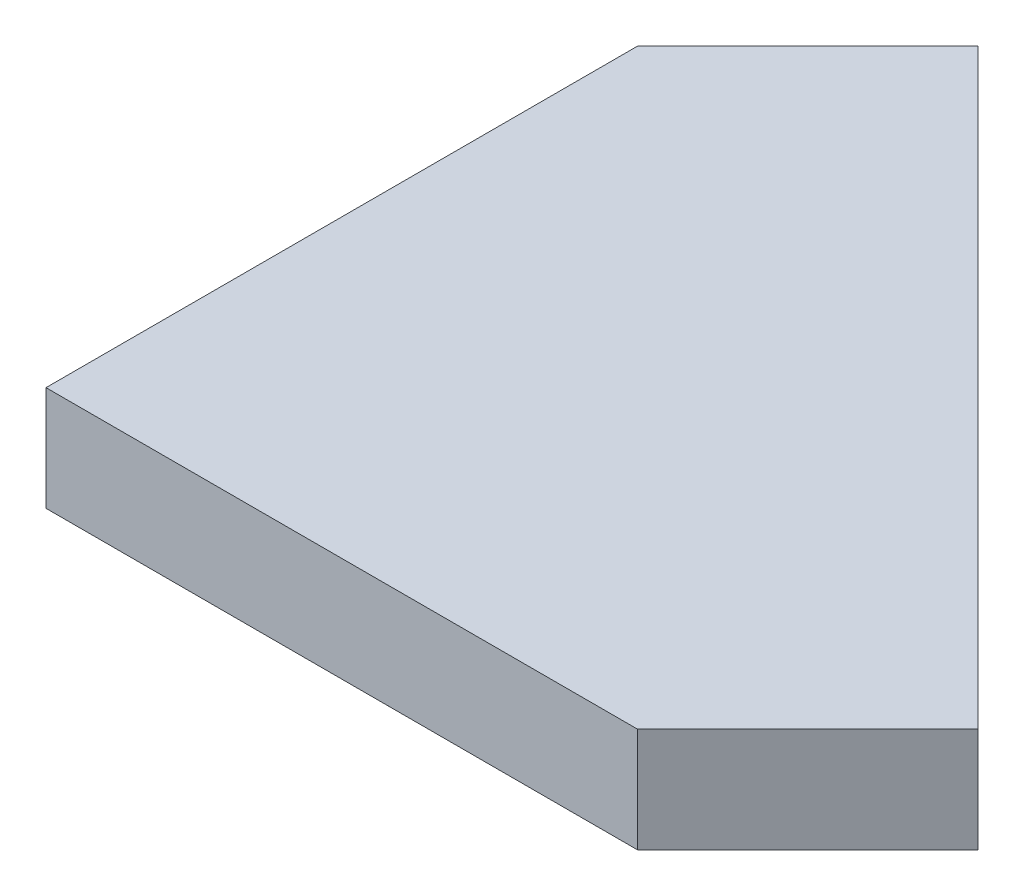
ISO-10303-21;
HEADER;
FILE_DESCRIPTION(('STEP AP214'),'2;1');
FILE_NAME('part.step','',(''),(''),'','','');
FILE_SCHEMA(('AUTOMOTIVE_DESIGN { 1 0 10303 214 1 1 1 1 }'));
ENDSEC;
DATA;
#1=APPLICATION_CONTEXT('core data for automotive mechanical design processes');
#2=APPLICATION_PROTOCOL_DEFINITION('international standard','automotive_design',2000,#1);
#3=PRODUCT_CONTEXT('',#1,'mechanical');
#4=PRODUCT('Part','Part','',(#3));
#5=PRODUCT_RELATED_PRODUCT_CATEGORY('part','',(#4));
#6=PRODUCT_DEFINITION_FORMATION('','',#4);
#7=PRODUCT_DEFINITION_CONTEXT('part definition',#1,'design');
#8=PRODUCT_DEFINITION('design','',#6,#7);
#9=PRODUCT_DEFINITION_SHAPE('','',#8);
#10=(LENGTH_UNIT() NAMED_UNIT(*) SI_UNIT(.MILLI.,.METRE.));
#11=(NAMED_UNIT(*) PLANE_ANGLE_UNIT() SI_UNIT($,.RADIAN.));
#12=(NAMED_UNIT(*) SI_UNIT($,.STERADIAN.) SOLID_ANGLE_UNIT());
#13=UNCERTAINTY_MEASURE_WITH_UNIT(LENGTH_MEASURE(1.E-05),#10,'distance_accuracy_value','');
#14=(GEOMETRIC_REPRESENTATION_CONTEXT(3) GLOBAL_UNCERTAINTY_ASSIGNED_CONTEXT((#13)) GLOBAL_UNIT_ASSIGNED_CONTEXT((#10,
#11,#12)) REPRESENTATION_CONTEXT('',''));
#15=CARTESIAN_POINT('',(0.,0.,0.));
#16=DIRECTION('',(0.,0.,1.));
#17=DIRECTION('',(1.,0.,0.));
#18=AXIS2_PLACEMENT_3D('',#15,#16,#17);
#19=CARTESIAN_POINT('',(0.,0.2,0.));
#20=DIRECTION('',(0.,1.,0.));
#21=DIRECTION('',(-1.,0.,0.));
#22=AXIS2_PLACEMENT_3D('',#19,#20,#21);
#23=PLANE('',#22);
#24=DIRECTION('',(0.707106781186551,0.,0.707106781186544));
#25=VECTOR('',#24,1.);
#26=CARTESIAN_POINT('',(-2.79289321881343,0.199999999999986,3.92426406871196));
#27=LINE('',#26,#25);
#28=CARTESIAN_POINT('',(-3.92426406871191,0.19999999999999,2.79289321881348));
#29=VERTEX_POINT('',#28);
#30=CARTESIAN_POINT('',(-2.79289321881343,0.199999999999986,3.92426406871196));
#31=VERTEX_POINT('',#30);
#32=EDGE_CURVE('E11',#29,#31,#27,.T.);
#33=ORIENTED_EDGE('',*,*,#32,.F.);
#34=DIRECTION('',(0.70710678118665,0.,-0.707106781186445));
#35=VECTOR('',#34,1.);
#36=CARTESIAN_POINT('',(-3.92426406871191,0.19999999999999,2.79289321881348));
#37=LINE('',#36,#35);
#38=CARTESIAN_POINT('',(-4.24999999999998,0.199999999999989,3.11862915010145));
#39=VERTEX_POINT('',#38);
#40=EDGE_CURVE('E24',#39,#29,#37,.T.);
#41=ORIENTED_EDGE('',*,*,#40,.F.);
#42=DIRECTION('',(0.,0.,-1.));
#43=VECTOR('',#42,1.);
#44=CARTESIAN_POINT('',(-4.24999999999998,0.199999999999989,3.11862915010146));
#45=LINE('',#44,#43);
#46=CARTESIAN_POINT('',(-4.24999999999998,0.199999999999985,4.25000000000002));
#47=VERTEX_POINT('',#46);
#48=EDGE_CURVE('E81',#47,#39,#45,.T.);
#49=ORIENTED_EDGE('',*,*,#48,.F.);
#50=DIRECTION('',(-1.,0.,0.));
#51=VECTOR('',#50,1.);
#52=CARTESIAN_POINT('',(-4.24999999999998,0.199999999999985,4.25000000000002));
#53=LINE('',#52,#51);
#54=CARTESIAN_POINT('',(-3.11862915010149,0.199999999999986,4.25000000000002));
#55=VERTEX_POINT('',#54);
#56=EDGE_CURVE('E99',#55,#47,#53,.T.);
#57=ORIENTED_EDGE('',*,*,#56,.F.);
#58=DIRECTION('',(-0.707106781186547,0.,0.707106781186548));
#59=VECTOR('',#58,1.);
#60=CARTESIAN_POINT('',(-3.11862915010149,0.199999999999985,4.25000000000002));
#61=LINE('',#60,#59);
#62=EDGE_CURVE('E96',#31,#55,#61,.T.);
#63=ORIENTED_EDGE('',*,*,#62,.F.);
#64=EDGE_LOOP('',(#33,#41,#49,#57,#63));
#65=FACE_BOUND('',#64,.T.);
#66=ADVANCED_FACE('F17',(#65),#23,.T.);
#67=CARTESIAN_POINT('',(0.,0.,0.));
#68=DIRECTION('',(0.,1.,0.));
#69=DIRECTION('',(0.,0.,1.));
#70=AXIS2_PLACEMENT_3D('',#67,#68,#69);
#71=PLANE('',#70);
#72=DIRECTION('',(0.707106781186551,0.,0.707106781186544));
#73=VECTOR('',#72,1.);
#74=CARTESIAN_POINT('',(-2.79289321881343,0.,3.92426406871196));
#75=LINE('',#74,#73);
#76=CARTESIAN_POINT('',(-3.92426406871191,0.,2.79289321881348));
#77=VERTEX_POINT('',#76);
#78=CARTESIAN_POINT('',(-2.79289321881343,0.,3.92426406871196));
#79=VERTEX_POINT('',#78);
#80=EDGE_CURVE('E94',#77,#79,#75,.T.);
#81=ORIENTED_EDGE('',*,*,#80,.T.);
#82=DIRECTION('',(-0.707106781186547,0.,0.707106781186548));
#83=VECTOR('',#82,1.);
#84=CARTESIAN_POINT('',(-3.11862915010149,0.,4.25000000000002));
#85=LINE('',#84,#83);
#86=CARTESIAN_POINT('',(-3.11862915010149,0.,4.25000000000002));
#87=VERTEX_POINT('',#86);
#88=EDGE_CURVE('E92',#79,#87,#85,.T.);
#89=ORIENTED_EDGE('',*,*,#88,.T.);
#90=DIRECTION('',(-1.,0.,0.));
#91=VECTOR('',#90,1.);
#92=CARTESIAN_POINT('',(-4.24999999999998,0.,4.25000000000002));
#93=LINE('',#92,#91);
#94=CARTESIAN_POINT('',(-4.24999999999998,0.,4.25000000000002));
#95=VERTEX_POINT('',#94);
#96=EDGE_CURVE('E66',#87,#95,#93,.T.);
#97=ORIENTED_EDGE('',*,*,#96,.T.);
#98=DIRECTION('',(0.,0.,-1.));
#99=VECTOR('',#98,1.);
#100=CARTESIAN_POINT('',(-4.24999999999998,0.,3.11862915010145));
#101=LINE('',#100,#99);
#102=CARTESIAN_POINT('',(-4.24999999999998,0.,3.11862915010145));
#103=VERTEX_POINT('',#102);
#104=EDGE_CURVE('E60',#95,#103,#101,.T.);
#105=ORIENTED_EDGE('',*,*,#104,.T.);
#106=DIRECTION('',(0.70710678118665,0.,-0.707106781186445));
#107=VECTOR('',#106,1.);
#108=CARTESIAN_POINT('',(-3.92426406871191,0.,2.79289321881348));
#109=LINE('',#108,#107);
#110=EDGE_CURVE('E63',#103,#77,#109,.T.);
#111=ORIENTED_EDGE('',*,*,#110,.T.);
#112=EDGE_LOOP('',(#81,#89,#97,#105,#111));
#113=FACE_BOUND('',#112,.T.);
#114=ADVANCED_FACE('F62',(#113),#71,.F.);
#115=CARTESIAN_POINT('',(-3.11862915010149,4.22492235949961,4.25000000000003));
#116=DIRECTION('',(0.707106781186548,0.,0.707106781186547));
#117=DIRECTION('',(0.707106781186547,0.,-0.707106781186548));
#118=AXIS2_PLACEMENT_3D('',#115,#116,#117);
#119=PLANE('',#118);
#120=DIRECTION('',(0.,-1.,0.));
#121=VECTOR('',#120,1.);
#122=CARTESIAN_POINT('',(-2.79289321881343,4.22492235949961,3.92426406871197));
#123=LINE('',#122,#121);
#124=EDGE_CURVE('E77',#31,#79,#123,.T.);
#125=ORIENTED_EDGE('',*,*,#124,.F.);
#126=ORIENTED_EDGE('',*,*,#62,.T.);
#127=DIRECTION('',(0.,-1.,0.));
#128=VECTOR('',#127,1.);
#129=CARTESIAN_POINT('',(-3.11862915010149,4.22492235949961,4.25000000000003));
#130=LINE('',#129,#128);
#131=EDGE_CURVE('E84',#55,#87,#130,.T.);
#132=ORIENTED_EDGE('',*,*,#131,.T.);
#133=ORIENTED_EDGE('',*,*,#88,.F.);
#134=EDGE_LOOP('',(#125,#126,#132,#133));
#135=FACE_BOUND('',#134,.T.);
#136=ADVANCED_FACE('F106',(#135),#119,.T.);
#137=CARTESIAN_POINT('',(-4.24999999999998,4.22492235949961,4.25000000000003));
#138=DIRECTION('',(0.,0.,1.));
#139=DIRECTION('',(0.,-1.,0.));
#140=AXIS2_PLACEMENT_3D('',#137,#138,#139);
#141=PLANE('',#140);
#142=ORIENTED_EDGE('',*,*,#131,.F.);
#143=ORIENTED_EDGE('',*,*,#56,.T.);
#144=DIRECTION('',(0.,-1.,0.));
#145=VECTOR('',#144,1.);
#146=CARTESIAN_POINT('',(-4.24999999999998,4.22492235949961,4.25000000000003));
#147=LINE('',#146,#145);
#148=EDGE_CURVE('E82',#47,#95,#147,.T.);
#149=ORIENTED_EDGE('',*,*,#148,.T.);
#150=ORIENTED_EDGE('',*,*,#96,.F.);
#151=EDGE_LOOP('',(#142,#143,#149,#150));
#152=FACE_BOUND('',#151,.T.);
#153=ADVANCED_FACE('F109',(#152),#141,.T.);
#154=CARTESIAN_POINT('',(-4.24999999999998,4.22492235949961,3.11862915010147));
#155=DIRECTION('',(-1.,0.,0.));
#156=DIRECTION('',(0.,-1.,0.));
#157=AXIS2_PLACEMENT_3D('',#154,#155,#156);
#158=PLANE('',#157);
#159=ORIENTED_EDGE('',*,*,#148,.F.);
#160=ORIENTED_EDGE('',*,*,#48,.T.);
#161=DIRECTION('',(0.,-1.,0.));
#162=VECTOR('',#161,1.);
#163=CARTESIAN_POINT('',(-4.24999999999998,4.22492235949961,3.11862915010147));
#164=LINE('',#163,#162);
#165=EDGE_CURVE('E75',#39,#103,#164,.T.);
#166=ORIENTED_EDGE('',*,*,#165,.T.);
#167=ORIENTED_EDGE('',*,*,#104,.F.);
#168=EDGE_LOOP('',(#159,#160,#166,#167));
#169=FACE_BOUND('',#168,.T.);
#170=ADVANCED_FACE('F80',(#169),#158,.T.);
#171=CARTESIAN_POINT('',(-3.92426406871191,4.22492235949961,2.7928932188135));
#172=DIRECTION('',(-0.707106781186445,0.,-0.70710678118665));
#173=DIRECTION('',(-0.70710678118665,0.,0.707106781186445));
#174=AXIS2_PLACEMENT_3D('',#171,#172,#173);
#175=PLANE('',#174);
#176=ORIENTED_EDGE('',*,*,#165,.F.);
#177=ORIENTED_EDGE('',*,*,#40,.T.);
#178=DIRECTION('',(0.,-1.,0.));
#179=VECTOR('',#178,1.);
#180=CARTESIAN_POINT('',(-3.92426406871191,4.22492235949961,2.7928932188135));
#181=LINE('',#180,#179);
#182=EDGE_CURVE('E76',#29,#77,#181,.T.);
#183=ORIENTED_EDGE('',*,*,#182,.T.);
#184=ORIENTED_EDGE('',*,*,#110,.F.);
#185=EDGE_LOOP('',(#176,#177,#183,#184));
#186=FACE_BOUND('',#185,.T.);
#187=ADVANCED_FACE('F74',(#186),#175,.T.);
#188=CARTESIAN_POINT('',(-2.79289321881343,4.22492235949961,3.92426406871197));
#189=DIRECTION('',(0.707106781186544,0.,-0.707106781186551));
#190=DIRECTION('',(-0.707106781186551,0.,-0.707106781186544));
#191=AXIS2_PLACEMENT_3D('',#188,#189,#190);
#192=PLANE('',#191);
#193=ORIENTED_EDGE('',*,*,#182,.F.);
#194=ORIENTED_EDGE('',*,*,#32,.T.);
#195=ORIENTED_EDGE('',*,*,#124,.T.);
#196=ORIENTED_EDGE('',*,*,#80,.F.);
#197=EDGE_LOOP('',(#193,#194,#195,#196));
#198=FACE_BOUND('',#197,.T.);
#199=ADVANCED_FACE('F102',(#198),#192,.T.);
#200=CLOSED_SHELL('',(#66,#114,#136,#153,#170,#187,#199));
#201=MANIFOLD_SOLID_BREP('B1',#200);
#202=ADVANCED_BREP_SHAPE_REPRESENTATION('',(#18,#201),#14);
#203=SHAPE_DEFINITION_REPRESENTATION(#9,#202);
ENDSEC;
END-ISO-10303-21;
